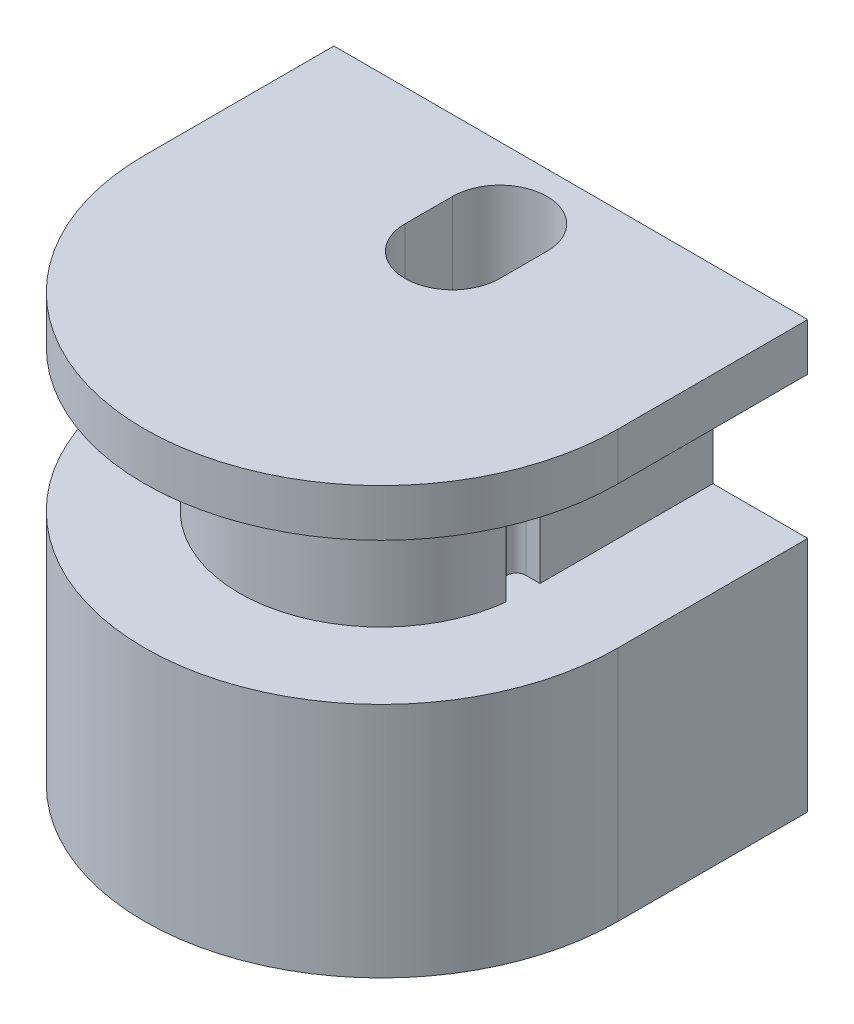
ISO-10303-21;
HEADER;
FILE_DESCRIPTION(('STEP AP214'),'2;1');
FILE_NAME('part.step','',(''),(''),'','','');
FILE_SCHEMA(('AUTOMOTIVE_DESIGN { 1 0 10303 214 1 1 1 1 }'));
ENDSEC;
DATA;
#1=APPLICATION_CONTEXT('core data for automotive mechanical design processes');
#2=APPLICATION_PROTOCOL_DEFINITION('international standard','automotive_design',2000,#1);
#3=PRODUCT_CONTEXT('',#1,'mechanical');
#4=PRODUCT('Part','Part','',(#3));
#5=PRODUCT_RELATED_PRODUCT_CATEGORY('part','',(#4));
#6=PRODUCT_DEFINITION_FORMATION('','',#4);
#7=PRODUCT_DEFINITION_CONTEXT('part definition',#1,'design');
#8=PRODUCT_DEFINITION('design','',#6,#7);
#9=PRODUCT_DEFINITION_SHAPE('','',#8);
#10=(LENGTH_UNIT() NAMED_UNIT(*) SI_UNIT(.MILLI.,.METRE.));
#11=(NAMED_UNIT(*) PLANE_ANGLE_UNIT() SI_UNIT($,.RADIAN.));
#12=(NAMED_UNIT(*) SI_UNIT($,.STERADIAN.) SOLID_ANGLE_UNIT());
#13=UNCERTAINTY_MEASURE_WITH_UNIT(LENGTH_MEASURE(1.E-05),#10,'distance_accuracy_value','');
#14=(GEOMETRIC_REPRESENTATION_CONTEXT(3) GLOBAL_UNCERTAINTY_ASSIGNED_CONTEXT((#13)) GLOBAL_UNIT_ASSIGNED_CONTEXT((#10,
#11,#12)) REPRESENTATION_CONTEXT('',''));
#15=CARTESIAN_POINT('',(0.,0.,0.));
#16=DIRECTION('',(0.,0.,1.));
#17=DIRECTION('',(1.,0.,0.));
#18=AXIS2_PLACEMENT_3D('',#15,#16,#17);
#19=CARTESIAN_POINT('',(-5.,5.,0.));
#20=DIRECTION('',(1.,0.,0.));
#21=DIRECTION('',(0.,0.,-1.));
#22=AXIS2_PLACEMENT_3D('',#19,#20,#21);
#23=PLANE('',#22);
#24=DIRECTION('',(0.,0.,1.));
#25=VECTOR('',#24,1.);
#26=CARTESIAN_POINT('',(-5.,0.,0.));
#27=LINE('',#26,#25);
#28=CARTESIAN_POINT('',(-5.,0.,0.));
#29=VERTEX_POINT('',#28);
#30=CARTESIAN_POINT('',(-5.,0.,4.));
#31=VERTEX_POINT('',#30);
#32=EDGE_CURVE('E218',#29,#31,#27,.T.);
#33=ORIENTED_EDGE('',*,*,#32,.T.);
#34=DIRECTION('',(0.,-1.,0.));
#35=VECTOR('',#34,1.);
#36=CARTESIAN_POINT('',(-5.,5.,4.));
#37=LINE('',#36,#35);
#38=CARTESIAN_POINT('',(-5.,5.,4.));
#39=VERTEX_POINT('',#38);
#40=EDGE_CURVE('E238',#39,#31,#37,.T.);
#41=ORIENTED_EDGE('',*,*,#40,.F.);
#42=DIRECTION('',(0.,0.,1.));
#43=VECTOR('',#42,1.);
#44=CARTESIAN_POINT('',(-5.,5.,0.));
#45=LINE('',#44,#43);
#46=CARTESIAN_POINT('',(-5.,5.,0.));
#47=VERTEX_POINT('',#46);
#48=EDGE_CURVE('E220',#47,#39,#45,.T.);
#49=ORIENTED_EDGE('',*,*,#48,.F.);
#50=DIRECTION('',(0.,-1.,0.));
#51=VECTOR('',#50,1.);
#52=CARTESIAN_POINT('',(-5.,5.,0.));
#53=LINE('',#52,#51);
#54=EDGE_CURVE('E237',#47,#29,#53,.T.);
#55=ORIENTED_EDGE('',*,*,#54,.T.);
#56=EDGE_LOOP('',(#33,#41,#49,#55));
#57=FACE_BOUND('',#56,.T.);
#58=ADVANCED_FACE('F34',(#57),#23,.F.);
#59=CARTESIAN_POINT('',(0.,5.,4.));
#60=DIRECTION('',(0.,-1.,0.));
#61=DIRECTION('',(0.,0.,-1.));
#62=AXIS2_PLACEMENT_3D('',#59,#60,#61);
#63=CYLINDRICAL_SURFACE('',#62,5.);
#64=CARTESIAN_POINT('',(0.,0.,4.));
#65=DIRECTION('',(0.,1.,0.));
#66=DIRECTION('',(0.,0.,1.));
#67=AXIS2_PLACEMENT_3D('',#64,#65,#66);
#68=CIRCLE('',#67,5.);
#69=CARTESIAN_POINT('',(5.,0.,4.));
#70=VERTEX_POINT('',#69);
#71=EDGE_CURVE('E251',#31,#70,#68,.T.);
#72=ORIENTED_EDGE('',*,*,#71,.T.);
#73=DIRECTION('',(0.,-1.,0.));
#74=VECTOR('',#73,1.);
#75=CARTESIAN_POINT('',(5.,5.,4.));
#76=LINE('',#75,#74);
#77=CARTESIAN_POINT('',(5.,5.,4.));
#78=VERTEX_POINT('',#77);
#79=EDGE_CURVE('E241',#78,#70,#76,.T.);
#80=ORIENTED_EDGE('',*,*,#79,.F.);
#81=CARTESIAN_POINT('',(0.,5.,4.));
#82=DIRECTION('',(0.,1.,0.));
#83=DIRECTION('',(0.,0.,1.));
#84=AXIS2_PLACEMENT_3D('',#81,#82,#83);
#85=CIRCLE('',#84,5.);
#86=EDGE_CURVE('E223',#39,#78,#85,.T.);
#87=ORIENTED_EDGE('',*,*,#86,.F.);
#88=ORIENTED_EDGE('',*,*,#40,.T.);
#89=EDGE_LOOP('',(#72,#80,#87,#88));
#90=FACE_BOUND('',#89,.T.);
#91=ADVANCED_FACE('F264',(#90),#63,.T.);
#92=CARTESIAN_POINT('',(5.,5.,0.));
#93=DIRECTION('',(-1.,0.,0.));
#94=DIRECTION('',(0.,0.,1.));
#95=AXIS2_PLACEMENT_3D('',#92,#93,#94);
#96=PLANE('',#95);
#97=DIRECTION('',(0.,0.,-1.));
#98=VECTOR('',#97,1.);
#99=CARTESIAN_POINT('',(5.,0.,0.));
#100=LINE('',#99,#98);
#101=CARTESIAN_POINT('',(5.,0.,0.));
#102=VERTEX_POINT('',#101);
#103=EDGE_CURVE('E250',#70,#102,#100,.T.);
#104=ORIENTED_EDGE('',*,*,#103,.T.);
#105=DIRECTION('',(0.,-1.,0.));
#106=VECTOR('',#105,1.);
#107=CARTESIAN_POINT('',(5.,5.,0.));
#108=LINE('',#107,#106);
#109=CARTESIAN_POINT('',(5.,5.,0.));
#110=VERTEX_POINT('',#109);
#111=EDGE_CURVE('E244',#110,#102,#108,.T.);
#112=ORIENTED_EDGE('',*,*,#111,.F.);
#113=DIRECTION('',(0.,0.,-1.));
#114=VECTOR('',#113,1.);
#115=CARTESIAN_POINT('',(5.,5.,0.));
#116=LINE('',#115,#114);
#117=EDGE_CURVE('E226',#78,#110,#116,.T.);
#118=ORIENTED_EDGE('',*,*,#117,.F.);
#119=ORIENTED_EDGE('',*,*,#79,.T.);
#120=EDGE_LOOP('',(#104,#112,#118,#119));
#121=FACE_BOUND('',#120,.T.);
#122=ADVANCED_FACE('F273',(#121),#96,.F.);
#123=CARTESIAN_POINT('',(-5.,5.,0.));
#124=DIRECTION('',(0.,0.,1.));
#125=DIRECTION('',(1.,0.,0.));
#126=AXIS2_PLACEMENT_3D('',#123,#124,#125);
#127=PLANE('',#126);
#128=DIRECTION('',(-1.,0.,0.));
#129=VECTOR('',#128,1.);
#130=CARTESIAN_POINT('',(-5.,0.,0.));
#131=LINE('',#130,#129);
#132=EDGE_CURVE('E224',#102,#29,#131,.T.);
#133=ORIENTED_EDGE('',*,*,#132,.T.);
#134=ORIENTED_EDGE('',*,*,#54,.F.);
#135=DIRECTION('',(-1.,0.,0.));
#136=VECTOR('',#135,1.);
#137=CARTESIAN_POINT('',(-5.,5.,0.));
#138=LINE('',#137,#136);
#139=CARTESIAN_POINT('',(-3.,5.,0.));
#140=VERTEX_POINT('',#139);
#141=EDGE_CURVE('E228',#140,#47,#138,.T.);
#142=ORIENTED_EDGE('',*,*,#141,.F.);
#143=DIRECTION('',(0.,-1.,0.));
#144=VECTOR('',#143,1.);
#145=CARTESIAN_POINT('',(-3.,8.,0.));
#146=LINE('',#145,#144);
#147=CARTESIAN_POINT('',(-3.,8.,0.));
#148=VERTEX_POINT('',#147);
#149=EDGE_CURVE('E558',#148,#140,#146,.T.);
#150=ORIENTED_EDGE('',*,*,#149,.F.);
#151=DIRECTION('',(-1.,0.,0.));
#152=VECTOR('',#151,1.);
#153=CARTESIAN_POINT('',(-5.,8.,0.));
#154=LINE('',#153,#152);
#155=CARTESIAN_POINT('',(-5.,8.,0.));
#156=VERTEX_POINT('',#155);
#157=EDGE_CURVE('E373',#148,#156,#154,.T.);
#158=ORIENTED_EDGE('',*,*,#157,.T.);
#159=DIRECTION('',(0.,-1.,0.));
#160=VECTOR('',#159,1.);
#161=CARTESIAN_POINT('',(-5.,9.,0.));
#162=LINE('',#161,#160);
#163=CARTESIAN_POINT('',(-5.,9.,0.));
#164=VERTEX_POINT('',#163);
#165=EDGE_CURVE('E366',#164,#156,#162,.T.);
#166=ORIENTED_EDGE('',*,*,#165,.F.);
#167=DIRECTION('',(-1.,0.,0.));
#168=VECTOR('',#167,1.);
#169=CARTESIAN_POINT('',(-5.,9.,0.));
#170=LINE('',#169,#168);
#171=CARTESIAN_POINT('',(5.,9.,0.));
#172=VERTEX_POINT('',#171);
#173=EDGE_CURVE('E364',#172,#164,#170,.T.);
#174=ORIENTED_EDGE('',*,*,#173,.F.);
#175=DIRECTION('',(0.,-1.,0.));
#176=VECTOR('',#175,1.);
#177=CARTESIAN_POINT('',(5.,9.,0.));
#178=LINE('',#177,#176);
#179=CARTESIAN_POINT('',(5.,8.,0.));
#180=VERTEX_POINT('',#179);
#181=EDGE_CURVE('E388',#172,#180,#178,.T.);
#182=ORIENTED_EDGE('',*,*,#181,.T.);
#183=CARTESIAN_POINT('',(3.,8.,0.));
#184=VERTEX_POINT('',#183);
#185=EDGE_CURVE('E360',#180,#184,#154,.T.);
#186=ORIENTED_EDGE('',*,*,#185,.T.);
#187=DIRECTION('',(0.,-1.,0.));
#188=VECTOR('',#187,1.);
#189=CARTESIAN_POINT('',(3.,8.,0.));
#190=LINE('',#189,#188);
#191=CARTESIAN_POINT('',(3.,5.,0.));
#192=VERTEX_POINT('',#191);
#193=EDGE_CURVE('E219',#184,#192,#190,.T.);
#194=ORIENTED_EDGE('',*,*,#193,.T.);
#195=EDGE_CURVE('E195',#110,#192,#138,.T.);
#196=ORIENTED_EDGE('',*,*,#195,.F.);
#197=ORIENTED_EDGE('',*,*,#111,.T.);
#198=EDGE_LOOP('',(#133,#134,#142,#150,#158,#166,#174,#182,#186,#194,#196,#197));
#199=FACE_BOUND('',#198,.T.);
#200=ADVANCED_FACE('F270',(#199),#127,.F.);
#201=CARTESIAN_POINT('',(0.,5.,4.));
#202=DIRECTION('',(0.,1.,0.));
#203=DIRECTION('',(0.,0.,1.));
#204=AXIS2_PLACEMENT_3D('',#201,#202,#203);
#205=PLANE('',#204);
#206=DIRECTION('',(1.,0.,0.));
#207=VECTOR('',#206,1.);
#208=CARTESIAN_POINT('',(2.5,5.,3.65));
#209=LINE('',#208,#207);
#210=CARTESIAN_POINT('',(2.7,5.,3.65));
#211=VERTEX_POINT('',#210);
#212=CARTESIAN_POINT('',(3.,5.,3.65));
#213=VERTEX_POINT('',#212);
#214=EDGE_CURVE('E175',#211,#213,#209,.T.);
#215=ORIENTED_EDGE('',*,*,#214,.F.);
#216=CARTESIAN_POINT('',(2.7,5.,3.85));
#217=DIRECTION('',(0.,1.,0.));
#218=DIRECTION('',(0.,0.,1.));
#219=AXIS2_PLACEMENT_3D('',#216,#217,#218);
#220=CIRCLE('',#219,0.2);
#221=CARTESIAN_POINT('',(2.5,5.,3.85));
#222=VERTEX_POINT('',#221);
#223=EDGE_CURVE('E42',#211,#222,#220,.T.);
#224=ORIENTED_EDGE('',*,*,#223,.T.);
#225=DIRECTION('',(0.,0.,-1.));
#226=VECTOR('',#225,1.);
#227=CARTESIAN_POINT('',(2.5,5.,3.65));
#228=LINE('',#227,#226);
#229=CARTESIAN_POINT('',(2.5,5.,4.15));
#230=VERTEX_POINT('',#229);
#231=EDGE_CURVE('E311',#230,#222,#228,.T.);
#232=ORIENTED_EDGE('',*,*,#231,.F.);
#233=CARTESIAN_POINT('',(2.7,5.,4.15));
#234=DIRECTION('',(0.,1.,0.));
#235=DIRECTION('',(0.,0.,1.));
#236=AXIS2_PLACEMENT_3D('',#233,#234,#235);
#237=CIRCLE('',#236,0.2);
#238=CARTESIAN_POINT('',(2.7,5.,4.35));
#239=VERTEX_POINT('',#238);
#240=EDGE_CURVE('E49',#230,#239,#237,.T.);
#241=ORIENTED_EDGE('',*,*,#240,.T.);
#242=DIRECTION('',(1.,0.,0.));
#243=VECTOR('',#242,1.);
#244=CARTESIAN_POINT('',(2.5,5.,4.35));
#245=LINE('',#244,#243);
#246=CARTESIAN_POINT('',(2.97951338308792,5.,4.35));
#247=VERTEX_POINT('',#246);
#248=EDGE_CURVE('E183',#239,#247,#245,.T.);
#249=ORIENTED_EDGE('',*,*,#248,.T.);
#250=CARTESIAN_POINT('',(0.,5.,4.));
#251=DIRECTION('',(0.,1.,0.));
#252=DIRECTION('',(0.,0.,1.));
#253=AXIS2_PLACEMENT_3D('',#250,#251,#252);
#254=CIRCLE('',#253,3.);
#255=CARTESIAN_POINT('',(-3.,5.,4.));
#256=VERTEX_POINT('',#255);
#257=EDGE_CURVE('E198',#256,#247,#254,.T.);
#258=ORIENTED_EDGE('',*,*,#257,.F.);
#259=DIRECTION('',(0.,0.,1.));
#260=VECTOR('',#259,1.);
#261=CARTESIAN_POINT('',(-3.,5.,0.));
#262=LINE('',#261,#260);
#263=EDGE_CURVE('E204',#140,#256,#262,.T.);
#264=ORIENTED_EDGE('',*,*,#263,.F.);
#265=ORIENTED_EDGE('',*,*,#141,.T.);
#266=ORIENTED_EDGE('',*,*,#48,.T.);
#267=ORIENTED_EDGE('',*,*,#86,.T.);
#268=ORIENTED_EDGE('',*,*,#117,.T.);
#269=ORIENTED_EDGE('',*,*,#195,.T.);
#270=DIRECTION('',(0.,0.,-1.));
#271=VECTOR('',#270,1.);
#272=CARTESIAN_POINT('',(3.,5.,0.));
#273=LINE('',#272,#271);
#274=EDGE_CURVE('E188',#213,#192,#273,.T.);
#275=ORIENTED_EDGE('',*,*,#274,.F.);
#276=EDGE_LOOP('',(#215,#224,#232,#241,#249,#258,#264,#265,#266,#267,#268,#269,#275));
#277=FACE_BOUND('',#276,.T.);
#278=ADVANCED_FACE('F193',(#277),#205,.T.);
#279=CARTESIAN_POINT('',(0.,0.,4.));
#280=DIRECTION('',(0.,1.,0.));
#281=DIRECTION('',(0.,0.,1.));
#282=AXIS2_PLACEMENT_3D('',#279,#280,#281);
#283=PLANE('',#282);
#284=DIRECTION('',(0.,0.,-1.));
#285=VECTOR('',#284,1.);
#286=CARTESIAN_POINT('',(1.,0.,1.5));
#287=LINE('',#286,#285);
#288=CARTESIAN_POINT('',(1.,0.,2.5));
#289=VERTEX_POINT('',#288);
#290=CARTESIAN_POINT('',(1.,0.,1.5));
#291=VERTEX_POINT('',#290);
#292=EDGE_CURVE('E334',#289,#291,#287,.T.);
#293=ORIENTED_EDGE('',*,*,#292,.T.);
#294=CARTESIAN_POINT('',(0.,0.,1.5));
#295=DIRECTION('',(0.,1.,0.));
#296=DIRECTION('',(0.,0.,1.));
#297=AXIS2_PLACEMENT_3D('',#294,#295,#296);
#298=CIRCLE('',#297,1.);
#299=CARTESIAN_POINT('',(-1.,0.,1.5));
#300=VERTEX_POINT('',#299);
#301=EDGE_CURVE('E324',#291,#300,#298,.T.);
#302=ORIENTED_EDGE('',*,*,#301,.T.);
#303=DIRECTION('',(0.,0.,1.));
#304=VECTOR('',#303,1.);
#305=CARTESIAN_POINT('',(-1.,0.,1.5));
#306=LINE('',#305,#304);
#307=CARTESIAN_POINT('',(-1.,0.,2.5));
#308=VERTEX_POINT('',#307);
#309=EDGE_CURVE('E327',#300,#308,#306,.T.);
#310=ORIENTED_EDGE('',*,*,#309,.T.);
#311=CARTESIAN_POINT('',(0.,0.,2.5));
#312=DIRECTION('',(0.,1.,0.));
#313=DIRECTION('',(0.,0.,1.));
#314=AXIS2_PLACEMENT_3D('',#311,#312,#313);
#315=CIRCLE('',#314,1.);
#316=EDGE_CURVE('E331',#308,#289,#315,.T.);
#317=ORIENTED_EDGE('',*,*,#316,.T.);
#318=EDGE_LOOP('',(#293,#302,#310,#317));
#319=FACE_BOUND('',#318,.T.);
#320=ORIENTED_EDGE('',*,*,#32,.F.);
#321=ORIENTED_EDGE('',*,*,#132,.F.);
#322=ORIENTED_EDGE('',*,*,#103,.F.);
#323=ORIENTED_EDGE('',*,*,#71,.F.);
#324=EDGE_LOOP('',(#320,#321,#322,#323));
#325=FACE_BOUND('',#324,.T.);
#326=ADVANCED_FACE('F262',(#319,#325),#283,.F.);
#327=CARTESIAN_POINT('',(-3.,8.,0.));
#328=DIRECTION('',(1.,0.,0.));
#329=DIRECTION('',(0.,0.,-1.));
#330=AXIS2_PLACEMENT_3D('',#327,#328,#329);
#331=PLANE('',#330);
#332=ORIENTED_EDGE('',*,*,#263,.T.);
#333=DIRECTION('',(0.,-1.,0.));
#334=VECTOR('',#333,1.);
#335=CARTESIAN_POINT('',(-3.,8.,4.));
#336=LINE('',#335,#334);
#337=CARTESIAN_POINT('',(-3.,8.,4.));
#338=VERTEX_POINT('',#337);
#339=EDGE_CURVE('E215',#338,#256,#336,.T.);
#340=ORIENTED_EDGE('',*,*,#339,.F.);
#341=DIRECTION('',(0.,0.,1.));
#342=VECTOR('',#341,1.);
#343=CARTESIAN_POINT('',(-3.,8.,0.));
#344=LINE('',#343,#342);
#345=EDGE_CURVE('E197',#148,#338,#344,.T.);
#346=ORIENTED_EDGE('',*,*,#345,.F.);
#347=ORIENTED_EDGE('',*,*,#149,.T.);
#348=EDGE_LOOP('',(#332,#340,#346,#347));
#349=FACE_BOUND('',#348,.T.);
#350=ADVANCED_FACE('F431',(#349),#331,.F.);
#351=CARTESIAN_POINT('',(0.,8.,4.));
#352=DIRECTION('',(0.,-1.,0.));
#353=DIRECTION('',(0.,0.,-1.));
#354=AXIS2_PLACEMENT_3D('',#351,#352,#353);
#355=CYLINDRICAL_SURFACE('',#354,3.);
#356=ORIENTED_EDGE('',*,*,#257,.T.);
#357=DIRECTION('',(0.,-1.,0.));
#358=VECTOR('',#357,1.);
#359=CARTESIAN_POINT('',(2.97951338308792,8.,4.35));
#360=LINE('',#359,#358);
#361=CARTESIAN_POINT('',(2.97951338308792,8.,4.35));
#362=VERTEX_POINT('',#361);
#363=EDGE_CURVE('E182',#247,#362,#360,.F.);
#364=ORIENTED_EDGE('',*,*,#363,.T.);
#365=CARTESIAN_POINT('',(0.,8.,4.));
#366=DIRECTION('',(0.,1.,0.));
#367=DIRECTION('',(0.,0.,1.));
#368=AXIS2_PLACEMENT_3D('',#365,#366,#367);
#369=CIRCLE('',#368,3.);
#370=EDGE_CURVE('E201',#338,#362,#369,.T.);
#371=ORIENTED_EDGE('',*,*,#370,.F.);
#372=ORIENTED_EDGE('',*,*,#339,.T.);
#373=EDGE_LOOP('',(#356,#364,#371,#372));
#374=FACE_BOUND('',#373,.T.);
#375=ADVANCED_FACE('F428',(#374),#355,.T.);
#376=CARTESIAN_POINT('',(3.,8.,0.));
#377=DIRECTION('',(-1.,0.,0.));
#378=DIRECTION('',(0.,0.,1.));
#379=AXIS2_PLACEMENT_3D('',#376,#377,#378);
#380=PLANE('',#379);
#381=DIRECTION('',(0.,0.,-1.));
#382=VECTOR('',#381,1.);
#383=CARTESIAN_POINT('',(3.,8.,0.));
#384=LINE('',#383,#382);
#385=CARTESIAN_POINT('',(3.,8.,3.65));
#386=VERTEX_POINT('',#385);
#387=EDGE_CURVE('E190',#386,#184,#384,.T.);
#388=ORIENTED_EDGE('',*,*,#387,.F.);
#389=DIRECTION('',(0.,1.,0.));
#390=VECTOR('',#389,1.);
#391=CARTESIAN_POINT('',(3.,8.,3.65));
#392=LINE('',#391,#390);
#393=EDGE_CURVE('E178',#213,#386,#392,.T.);
#394=ORIENTED_EDGE('',*,*,#393,.F.);
#395=ORIENTED_EDGE('',*,*,#274,.T.);
#396=ORIENTED_EDGE('',*,*,#193,.F.);
#397=EDGE_LOOP('',(#388,#394,#395,#396));
#398=FACE_BOUND('',#397,.T.);
#399=ADVANCED_FACE('F186',(#398),#380,.F.);
#400=CARTESIAN_POINT('',(0.,8.,4.));
#401=DIRECTION('',(0.,1.,0.));
#402=DIRECTION('',(0.,0.,1.));
#403=AXIS2_PLACEMENT_3D('',#400,#401,#402);
#404=PLANE('',#403);
#405=DIRECTION('',(0.,0.,1.));
#406=VECTOR('',#405,1.);
#407=CARTESIAN_POINT('',(2.5,8.,3.65));
#408=LINE('',#407,#406);
#409=CARTESIAN_POINT('',(2.5,8.,3.85));
#410=VERTEX_POINT('',#409);
#411=CARTESIAN_POINT('',(2.5,8.,4.15));
#412=VERTEX_POINT('',#411);
#413=EDGE_CURVE('E191',#410,#412,#408,.T.);
#414=ORIENTED_EDGE('',*,*,#413,.F.);
#415=CARTESIAN_POINT('',(2.7,8.,3.85));
#416=DIRECTION('',(0.,1.,0.));
#417=DIRECTION('',(0.,0.,1.));
#418=AXIS2_PLACEMENT_3D('',#415,#416,#417);
#419=CIRCLE('',#418,0.2);
#420=CARTESIAN_POINT('',(2.7,8.,3.65));
#421=VERTEX_POINT('',#420);
#422=EDGE_CURVE('E304',#410,#421,#419,.F.);
#423=ORIENTED_EDGE('',*,*,#422,.T.);
#424=DIRECTION('',(1.,0.,0.));
#425=VECTOR('',#424,1.);
#426=CARTESIAN_POINT('',(2.5,8.,3.65));
#427=LINE('',#426,#425);
#428=EDGE_CURVE('E313',#421,#386,#427,.T.);
#429=ORIENTED_EDGE('',*,*,#428,.T.);
#430=ORIENTED_EDGE('',*,*,#387,.T.);
#431=ORIENTED_EDGE('',*,*,#185,.F.);
#432=DIRECTION('',(0.,0.,-1.));
#433=VECTOR('',#432,1.);
#434=CARTESIAN_POINT('',(5.,8.,0.));
#435=LINE('',#434,#433);
#436=CARTESIAN_POINT('',(5.,8.,4.));
#437=VERTEX_POINT('',#436);
#438=EDGE_CURVE('E371',#437,#180,#435,.T.);
#439=ORIENTED_EDGE('',*,*,#438,.F.);
#440=CARTESIAN_POINT('',(0.,8.,4.));
#441=DIRECTION('',(0.,1.,0.));
#442=DIRECTION('',(0.,0.,1.));
#443=AXIS2_PLACEMENT_3D('',#440,#441,#442);
#444=CIRCLE('',#443,5.);
#445=CARTESIAN_POINT('',(-5.,8.,4.));
#446=VERTEX_POINT('',#445);
#447=EDGE_CURVE('E369',#446,#437,#444,.T.);
#448=ORIENTED_EDGE('',*,*,#447,.F.);
#449=DIRECTION('',(0.,0.,1.));
#450=VECTOR('',#449,1.);
#451=CARTESIAN_POINT('',(-5.,8.,0.));
#452=LINE('',#451,#450);
#453=EDGE_CURVE('E349',#156,#446,#452,.T.);
#454=ORIENTED_EDGE('',*,*,#453,.F.);
#455=ORIENTED_EDGE('',*,*,#157,.F.);
#456=ORIENTED_EDGE('',*,*,#345,.T.);
#457=ORIENTED_EDGE('',*,*,#370,.T.);
#458=DIRECTION('',(1.,0.,0.));
#459=VECTOR('',#458,1.);
#460=CARTESIAN_POINT('',(2.5,8.,4.35));
#461=LINE('',#460,#459);
#462=CARTESIAN_POINT('',(2.7,8.,4.35));
#463=VERTEX_POINT('',#462);
#464=EDGE_CURVE('E315',#463,#362,#461,.T.);
#465=ORIENTED_EDGE('',*,*,#464,.F.);
#466=CARTESIAN_POINT('',(2.7,8.,4.15));
#467=DIRECTION('',(0.,1.,0.));
#468=DIRECTION('',(0.,0.,1.));
#469=AXIS2_PLACEMENT_3D('',#466,#467,#468);
#470=CIRCLE('',#469,0.2);
#471=EDGE_CURVE('E306',#463,#412,#470,.F.);
#472=ORIENTED_EDGE('',*,*,#471,.T.);
#473=EDGE_LOOP('',(#414,#423,#429,#430,#431,#439,#448,#454,#455,#456,#457,#465,#472));
#474=FACE_BOUND('',#473,.T.);
#475=ADVANCED_FACE('F402',(#474),#404,.F.);
#476=CARTESIAN_POINT('',(-5.,9.,0.));
#477=DIRECTION('',(1.,0.,0.));
#478=DIRECTION('',(0.,0.,-1.));
#479=AXIS2_PLACEMENT_3D('',#476,#477,#478);
#480=PLANE('',#479);
#481=ORIENTED_EDGE('',*,*,#453,.T.);
#482=DIRECTION('',(0.,-1.,0.));
#483=VECTOR('',#482,1.);
#484=CARTESIAN_POINT('',(-5.,9.,4.));
#485=LINE('',#484,#483);
#486=CARTESIAN_POINT('',(-5.,9.,4.));
#487=VERTEX_POINT('',#486);
#488=EDGE_CURVE('E383',#487,#446,#485,.T.);
#489=ORIENTED_EDGE('',*,*,#488,.F.);
#490=DIRECTION('',(0.,0.,1.));
#491=VECTOR('',#490,1.);
#492=CARTESIAN_POINT('',(-5.,9.,0.));
#493=LINE('',#492,#491);
#494=EDGE_CURVE('E356',#164,#487,#493,.T.);
#495=ORIENTED_EDGE('',*,*,#494,.F.);
#496=ORIENTED_EDGE('',*,*,#165,.T.);
#497=EDGE_LOOP('',(#481,#489,#495,#496));
#498=FACE_BOUND('',#497,.T.);
#499=ADVANCED_FACE('F398',(#498),#480,.F.);
#500=CARTESIAN_POINT('',(0.,9.,4.));
#501=DIRECTION('',(0.,-1.,0.));
#502=DIRECTION('',(0.,0.,-1.));
#503=AXIS2_PLACEMENT_3D('',#500,#501,#502);
#504=CYLINDRICAL_SURFACE('',#503,5.);
#505=ORIENTED_EDGE('',*,*,#447,.T.);
#506=DIRECTION('',(0.,-1.,0.));
#507=VECTOR('',#506,1.);
#508=CARTESIAN_POINT('',(5.,9.,4.));
#509=LINE('',#508,#507);
#510=CARTESIAN_POINT('',(5.,9.,4.));
#511=VERTEX_POINT('',#510);
#512=EDGE_CURVE('E386',#511,#437,#509,.T.);
#513=ORIENTED_EDGE('',*,*,#512,.F.);
#514=CARTESIAN_POINT('',(0.,9.,4.));
#515=DIRECTION('',(0.,1.,0.));
#516=DIRECTION('',(0.,0.,1.));
#517=AXIS2_PLACEMENT_3D('',#514,#515,#516);
#518=CIRCLE('',#517,5.);
#519=EDGE_CURVE('E359',#487,#511,#518,.T.);
#520=ORIENTED_EDGE('',*,*,#519,.F.);
#521=ORIENTED_EDGE('',*,*,#488,.T.);
#522=EDGE_LOOP('',(#505,#513,#520,#521));
#523=FACE_BOUND('',#522,.T.);
#524=ADVANCED_FACE('F406',(#523),#504,.T.);
#525=CARTESIAN_POINT('',(5.,9.,0.));
#526=DIRECTION('',(-1.,0.,0.));
#527=DIRECTION('',(0.,0.,1.));
#528=AXIS2_PLACEMENT_3D('',#525,#526,#527);
#529=PLANE('',#528);
#530=ORIENTED_EDGE('',*,*,#438,.T.);
#531=ORIENTED_EDGE('',*,*,#181,.F.);
#532=DIRECTION('',(0.,0.,-1.));
#533=VECTOR('',#532,1.);
#534=CARTESIAN_POINT('',(5.,9.,0.));
#535=LINE('',#534,#533);
#536=EDGE_CURVE('E362',#511,#172,#535,.T.);
#537=ORIENTED_EDGE('',*,*,#536,.F.);
#538=ORIENTED_EDGE('',*,*,#512,.T.);
#539=EDGE_LOOP('',(#530,#531,#537,#538));
#540=FACE_BOUND('',#539,.T.);
#541=ADVANCED_FACE('F411',(#540),#529,.F.);
#542=CARTESIAN_POINT('',(0.,9.,4.));
#543=DIRECTION('',(0.,1.,0.));
#544=DIRECTION('',(0.,0.,1.));
#545=AXIS2_PLACEMENT_3D('',#542,#543,#544);
#546=PLANE('',#545);
#547=CARTESIAN_POINT('',(0.,9.,1.5));
#548=DIRECTION('',(0.,1.,0.));
#549=DIRECTION('',(0.,0.,1.));
#550=AXIS2_PLACEMENT_3D('',#547,#548,#549);
#551=CIRCLE('',#550,1.);
#552=CARTESIAN_POINT('',(1.,9.,1.5));
#553=VERTEX_POINT('',#552);
#554=CARTESIAN_POINT('',(-1.,9.,1.5));
#555=VERTEX_POINT('',#554);
#556=EDGE_CURVE('E323',#553,#555,#551,.T.);
#557=ORIENTED_EDGE('',*,*,#556,.F.);
#558=DIRECTION('',(0.,0.,-1.));
#559=VECTOR('',#558,1.);
#560=CARTESIAN_POINT('',(1.,9.,1.5));
#561=LINE('',#560,#559);
#562=CARTESIAN_POINT('',(1.,9.,2.5));
#563=VERTEX_POINT('',#562);
#564=EDGE_CURVE('E328',#563,#553,#561,.T.);
#565=ORIENTED_EDGE('',*,*,#564,.F.);
#566=CARTESIAN_POINT('',(0.,9.,2.5));
#567=DIRECTION('',(0.,1.,0.));
#568=DIRECTION('',(0.,0.,1.));
#569=AXIS2_PLACEMENT_3D('',#566,#567,#568);
#570=CIRCLE('',#569,1.);
#571=CARTESIAN_POINT('',(-1.,9.,2.5));
#572=VERTEX_POINT('',#571);
#573=EDGE_CURVE('E342',#572,#563,#570,.T.);
#574=ORIENTED_EDGE('',*,*,#573,.F.);
#575=DIRECTION('',(0.,0.,1.));
#576=VECTOR('',#575,1.);
#577=CARTESIAN_POINT('',(-1.,9.,1.5));
#578=LINE('',#577,#576);
#579=EDGE_CURVE('E339',#555,#572,#578,.T.);
#580=ORIENTED_EDGE('',*,*,#579,.F.);
#581=EDGE_LOOP('',(#557,#565,#574,#580));
#582=FACE_BOUND('',#581,.T.);
#583=ORIENTED_EDGE('',*,*,#494,.T.);
#584=ORIENTED_EDGE('',*,*,#519,.T.);
#585=ORIENTED_EDGE('',*,*,#536,.T.);
#586=ORIENTED_EDGE('',*,*,#173,.T.);
#587=EDGE_LOOP('',(#583,#584,#585,#586));
#588=FACE_BOUND('',#587,.T.);
#589=ADVANCED_FACE('F409',(#582,#588),#546,.T.);
#590=CARTESIAN_POINT('',(0.,0.,1.5));
#591=DIRECTION('',(0.,1.,0.));
#592=DIRECTION('',(0.,0.,1.));
#593=AXIS2_PLACEMENT_3D('',#590,#591,#592);
#594=CYLINDRICAL_SURFACE('',#593,1.);
#595=ORIENTED_EDGE('',*,*,#556,.T.);
#596=DIRECTION('',(0.,1.,0.));
#597=VECTOR('',#596,1.);
#598=CARTESIAN_POINT('',(-1.,0.,1.5));
#599=LINE('',#598,#597);
#600=EDGE_CURVE('E337',#300,#555,#599,.T.);
#601=ORIENTED_EDGE('',*,*,#600,.F.);
#602=ORIENTED_EDGE('',*,*,#301,.F.);
#603=DIRECTION('',(0.,1.,0.));
#604=VECTOR('',#603,1.);
#605=CARTESIAN_POINT('',(1.,0.,1.5));
#606=LINE('',#605,#604);
#607=EDGE_CURVE('E347',#291,#553,#606,.T.);
#608=ORIENTED_EDGE('',*,*,#607,.T.);
#609=EDGE_LOOP('',(#595,#601,#602,#608));
#610=FACE_BOUND('',#609,.T.);
#611=ADVANCED_FACE('F418',(#610),#594,.F.);
#612=CARTESIAN_POINT('',(1.,0.,1.5));
#613=DIRECTION('',(1.,0.,0.));
#614=DIRECTION('',(0.,0.,-1.));
#615=AXIS2_PLACEMENT_3D('',#612,#613,#614);
#616=PLANE('',#615);
#617=ORIENTED_EDGE('',*,*,#564,.T.);
#618=ORIENTED_EDGE('',*,*,#607,.F.);
#619=ORIENTED_EDGE('',*,*,#292,.F.);
#620=DIRECTION('',(0.,1.,0.));
#621=VECTOR('',#620,1.);
#622=CARTESIAN_POINT('',(1.,0.,2.5));
#623=LINE('',#622,#621);
#624=EDGE_CURVE('E350',#289,#563,#623,.T.);
#625=ORIENTED_EDGE('',*,*,#624,.T.);
#626=EDGE_LOOP('',(#617,#618,#619,#625));
#627=FACE_BOUND('',#626,.T.);
#628=ADVANCED_FACE('F445',(#627),#616,.F.);
#629=CARTESIAN_POINT('',(0.,0.,2.5));
#630=DIRECTION('',(0.,1.,0.));
#631=DIRECTION('',(0.,0.,1.));
#632=AXIS2_PLACEMENT_3D('',#629,#630,#631);
#633=CYLINDRICAL_SURFACE('',#632,1.);
#634=ORIENTED_EDGE('',*,*,#573,.T.);
#635=ORIENTED_EDGE('',*,*,#624,.F.);
#636=ORIENTED_EDGE('',*,*,#316,.F.);
#637=DIRECTION('',(0.,1.,0.));
#638=VECTOR('',#637,1.);
#639=CARTESIAN_POINT('',(-1.,0.,2.5));
#640=LINE('',#639,#638);
#641=EDGE_CURVE('E352',#308,#572,#640,.T.);
#642=ORIENTED_EDGE('',*,*,#641,.T.);
#643=EDGE_LOOP('',(#634,#635,#636,#642));
#644=FACE_BOUND('',#643,.T.);
#645=ADVANCED_FACE('F456',(#644),#633,.F.);
#646=CARTESIAN_POINT('',(-1.,0.,1.5));
#647=DIRECTION('',(-1.,0.,0.));
#648=DIRECTION('',(0.,0.,1.));
#649=AXIS2_PLACEMENT_3D('',#646,#647,#648);
#650=PLANE('',#649);
#651=ORIENTED_EDGE('',*,*,#579,.T.);
#652=ORIENTED_EDGE('',*,*,#641,.F.);
#653=ORIENTED_EDGE('',*,*,#309,.F.);
#654=ORIENTED_EDGE('',*,*,#600,.T.);
#655=EDGE_LOOP('',(#651,#652,#653,#654));
#656=FACE_BOUND('',#655,.T.);
#657=ADVANCED_FACE('F453',(#656),#650,.F.);
#658=CARTESIAN_POINT('',(2.5,8.,4.35));
#659=DIRECTION('',(0.,0.,1.));
#660=DIRECTION('',(1.,0.,0.));
#661=AXIS2_PLACEMENT_3D('',#658,#659,#660);
#662=PLANE('',#661);
#663=ORIENTED_EDGE('',*,*,#248,.F.);
#664=DIRECTION('',(0.,-1.,0.));
#665=VECTOR('',#664,1.);
#666=CARTESIAN_POINT('',(2.7,8.,4.35));
#667=LINE('',#666,#665);
#668=EDGE_CURVE('E11',#239,#463,#667,.F.);
#669=ORIENTED_EDGE('',*,*,#668,.T.);
#670=ORIENTED_EDGE('',*,*,#464,.T.);
#671=ORIENTED_EDGE('',*,*,#363,.F.);
#672=EDGE_LOOP('',(#663,#669,#670,#671));
#673=FACE_BOUND('',#672,.T.);
#674=ADVANCED_FACE('F463',(#673),#662,.F.);
#675=CARTESIAN_POINT('',(2.5,8.,3.65));
#676=DIRECTION('',(0.,0.,-1.));
#677=DIRECTION('',(-1.,0.,0.));
#678=AXIS2_PLACEMENT_3D('',#675,#676,#677);
#679=PLANE('',#678);
#680=ORIENTED_EDGE('',*,*,#428,.F.);
#681=DIRECTION('',(0.,1.,0.));
#682=VECTOR('',#681,1.);
#683=CARTESIAN_POINT('',(2.7,5.,3.65));
#684=LINE('',#683,#682);
#685=EDGE_CURVE('E57',#421,#211,#684,.F.);
#686=ORIENTED_EDGE('',*,*,#685,.T.);
#687=ORIENTED_EDGE('',*,*,#214,.T.);
#688=ORIENTED_EDGE('',*,*,#393,.T.);
#689=EDGE_LOOP('',(#680,#686,#687,#688));
#690=FACE_BOUND('',#689,.T.);
#691=ADVANCED_FACE('F177',(#690),#679,.F.);
#692=CARTESIAN_POINT('',(2.5,5.,3.65));
#693=DIRECTION('',(-1.,0.,0.));
#694=DIRECTION('',(0.,0.,1.));
#695=AXIS2_PLACEMENT_3D('',#692,#693,#694);
#696=PLANE('',#695);
#697=ORIENTED_EDGE('',*,*,#231,.T.);
#698=DIRECTION('',(0.,1.,0.));
#699=VECTOR('',#698,1.);
#700=CARTESIAN_POINT('',(2.5,8.,3.85));
#701=LINE('',#700,#699);
#702=EDGE_CURVE('E299',#222,#410,#701,.T.);
#703=ORIENTED_EDGE('',*,*,#702,.T.);
#704=ORIENTED_EDGE('',*,*,#413,.T.);
#705=DIRECTION('',(0.,-1.,0.));
#706=VECTOR('',#705,1.);
#707=CARTESIAN_POINT('',(2.5,5.,4.15));
#708=LINE('',#707,#706);
#709=EDGE_CURVE('E211',#412,#230,#708,.T.);
#710=ORIENTED_EDGE('',*,*,#709,.T.);
#711=EDGE_LOOP('',(#697,#703,#704,#710));
#712=FACE_BOUND('',#711,.T.);
#713=ADVANCED_FACE('F288',(#712),#696,.F.);
#714=CARTESIAN_POINT('',(2.7,5.,3.85));
#715=DIRECTION('',(0.,-1.,0.));
#716=DIRECTION('',(0.,0.,-1.));
#717=AXIS2_PLACEMENT_3D('',#714,#715,#716);
#718=CYLINDRICAL_SURFACE('',#717,0.2);
#719=ORIENTED_EDGE('',*,*,#223,.F.);
#720=ORIENTED_EDGE('',*,*,#685,.F.);
#721=ORIENTED_EDGE('',*,*,#422,.F.);
#722=ORIENTED_EDGE('',*,*,#702,.F.);
#723=EDGE_LOOP('',(#719,#720,#721,#722));
#724=FACE_BOUND('',#723,.T.);
#725=ADVANCED_FACE('F286',(#724),#718,.F.);
#726=CARTESIAN_POINT('',(2.7,5.,4.15));
#727=DIRECTION('',(0.,1.,0.));
#728=DIRECTION('',(0.,0.,1.));
#729=AXIS2_PLACEMENT_3D('',#726,#727,#728);
#730=CYLINDRICAL_SURFACE('',#729,0.2);
#731=ORIENTED_EDGE('',*,*,#471,.F.);
#732=ORIENTED_EDGE('',*,*,#668,.F.);
#733=ORIENTED_EDGE('',*,*,#240,.F.);
#734=ORIENTED_EDGE('',*,*,#709,.F.);
#735=EDGE_LOOP('',(#731,#732,#733,#734));
#736=FACE_BOUND('',#735,.T.);
#737=ADVANCED_FACE('F36',(#736),#730,.F.);
#738=CLOSED_SHELL('',(#58,#91,#122,#200,#278,#326,#350,#375,#399,#475,#499,#524,#541,#589,#611,
#628,#645,#657,#674,#691,#713,#725,#737));
#739=MANIFOLD_SOLID_BREP('B2',#738);
#740=ADVANCED_BREP_SHAPE_REPRESENTATION('',(#18,#739),#14);
#741=SHAPE_DEFINITION_REPRESENTATION(#9,#740);
ENDSEC;
END-ISO-10303-21;
